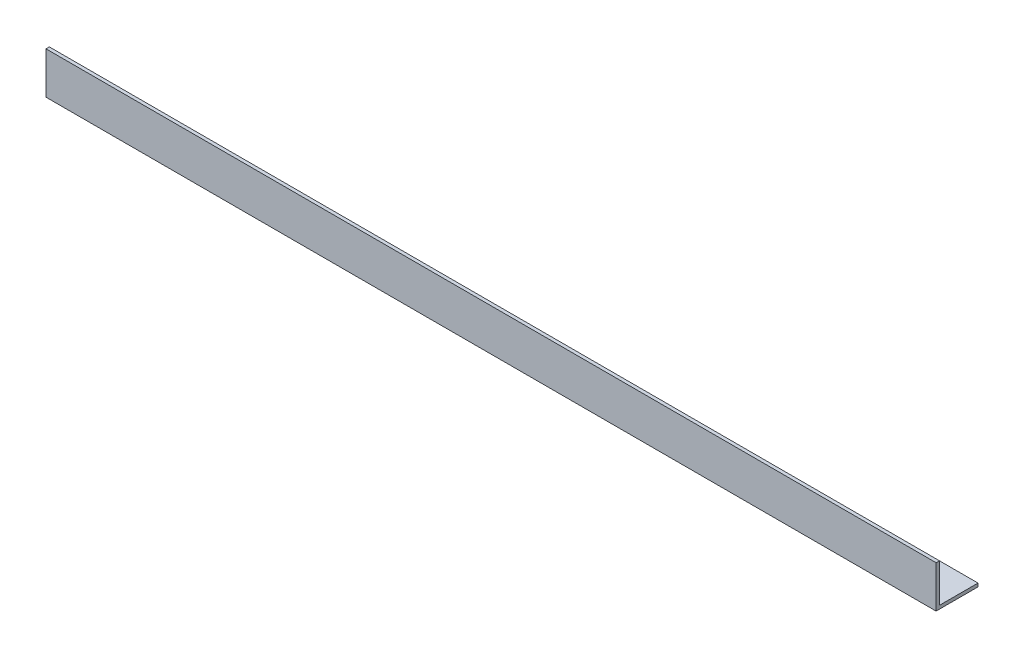
ISO-10303-21;
HEADER;
FILE_DESCRIPTION(('STEP AP214'),'2;1');
FILE_NAME('part.step','',(''),(''),'','','');
FILE_SCHEMA(('AUTOMOTIVE_DESIGN { 1 0 10303 214 1 1 1 1 }'));
ENDSEC;
DATA;
#1=APPLICATION_CONTEXT('core data for automotive mechanical design processes');
#2=APPLICATION_PROTOCOL_DEFINITION('international standard','automotive_design',2000,#1);
#3=PRODUCT_CONTEXT('',#1,'mechanical');
#4=PRODUCT('Part','Part','',(#3));
#5=PRODUCT_RELATED_PRODUCT_CATEGORY('part','',(#4));
#6=PRODUCT_DEFINITION_FORMATION('','',#4);
#7=PRODUCT_DEFINITION_CONTEXT('part definition',#1,'design');
#8=PRODUCT_DEFINITION('design','',#6,#7);
#9=PRODUCT_DEFINITION_SHAPE('','',#8);
#10=(LENGTH_UNIT() NAMED_UNIT(*) SI_UNIT(.MILLI.,.METRE.));
#11=(NAMED_UNIT(*) PLANE_ANGLE_UNIT() SI_UNIT($,.RADIAN.));
#12=(NAMED_UNIT(*) SI_UNIT($,.STERADIAN.) SOLID_ANGLE_UNIT());
#13=UNCERTAINTY_MEASURE_WITH_UNIT(LENGTH_MEASURE(1.E-05),#10,'distance_accuracy_value','');
#14=(GEOMETRIC_REPRESENTATION_CONTEXT(3) GLOBAL_UNCERTAINTY_ASSIGNED_CONTEXT((#13)) GLOBAL_UNIT_ASSIGNED_CONTEXT((#10,
#11,#12)) REPRESENTATION_CONTEXT('',''));
#15=CARTESIAN_POINT('',(0.,0.,0.));
#16=DIRECTION('',(0.,0.,1.));
#17=DIRECTION('',(1.,0.,0.));
#18=AXIS2_PLACEMENT_3D('',#15,#16,#17);
#19=CARTESIAN_POINT('',(531.,0.,0.));
#20=DIRECTION('',(0.,1.,0.));
#21=DIRECTION('',(0.,0.,1.));
#22=AXIS2_PLACEMENT_3D('',#19,#20,#21);
#23=PLANE('',#22);
#24=DIRECTION('',(0.,0.,-1.));
#25=VECTOR('',#24,1.);
#26=CARTESIAN_POINT('',(0.,0.,0.));
#27=LINE('',#26,#25);
#28=CARTESIAN_POINT('',(0.,0.,0.));
#29=VERTEX_POINT('',#28);
#30=CARTESIAN_POINT('',(0.,0.,-25.));
#31=VERTEX_POINT('',#30);
#32=EDGE_CURVE('E117',#29,#31,#27,.T.);
#33=ORIENTED_EDGE('',*,*,#32,.T.);
#34=DIRECTION('',(-1.,0.,0.));
#35=VECTOR('',#34,1.);
#36=CARTESIAN_POINT('',(531.,0.,-25.));
#37=LINE('',#36,#35);
#38=CARTESIAN_POINT('',(531.,0.,-25.));
#39=VERTEX_POINT('',#38);
#40=EDGE_CURVE('E11',#39,#31,#37,.T.);
#41=ORIENTED_EDGE('',*,*,#40,.F.);
#42=DIRECTION('',(0.,0.,-1.));
#43=VECTOR('',#42,1.);
#44=CARTESIAN_POINT('',(531.,0.,0.));
#45=LINE('',#44,#43);
#46=CARTESIAN_POINT('',(531.,0.,0.));
#47=VERTEX_POINT('',#46);
#48=EDGE_CURVE('E82',#47,#39,#45,.T.);
#49=ORIENTED_EDGE('',*,*,#48,.F.);
#50=DIRECTION('',(-1.,0.,0.));
#51=VECTOR('',#50,1.);
#52=CARTESIAN_POINT('',(531.,0.,0.));
#53=LINE('',#52,#51);
#54=EDGE_CURVE('E113',#47,#29,#53,.T.);
#55=ORIENTED_EDGE('',*,*,#54,.T.);
#56=EDGE_LOOP('',(#33,#41,#49,#55));
#57=FACE_BOUND('',#56,.T.);
#58=ADVANCED_FACE('F36',(#57),#23,.F.);
#59=CARTESIAN_POINT('',(531.,2.,-25.));
#60=DIRECTION('',(0.,0.,-1.));
#61=DIRECTION('',(-1.,0.,0.));
#62=AXIS2_PLACEMENT_3D('',#59,#60,#61);
#63=PLANE('',#62);
#64=DIRECTION('',(0.,-1.,0.));
#65=VECTOR('',#64,1.);
#66=CARTESIAN_POINT('',(0.,2.,-25.));
#67=LINE('',#66,#65);
#68=CARTESIAN_POINT('',(0.,2.,-25.));
#69=VERTEX_POINT('',#68);
#70=EDGE_CURVE('E120',#69,#31,#67,.T.);
#71=ORIENTED_EDGE('',*,*,#70,.F.);
#72=DIRECTION('',(-1.,0.,0.));
#73=VECTOR('',#72,1.);
#74=CARTESIAN_POINT('',(531.,2.,-25.));
#75=LINE('',#74,#73);
#76=CARTESIAN_POINT('',(531.,2.,-25.));
#77=VERTEX_POINT('',#76);
#78=EDGE_CURVE('E44',#77,#69,#75,.T.);
#79=ORIENTED_EDGE('',*,*,#78,.F.);
#80=DIRECTION('',(0.,-1.,0.));
#81=VECTOR('',#80,1.);
#82=CARTESIAN_POINT('',(531.,2.,-25.));
#83=LINE('',#82,#81);
#84=EDGE_CURVE('E206',#77,#39,#83,.T.);
#85=ORIENTED_EDGE('',*,*,#84,.T.);
#86=ORIENTED_EDGE('',*,*,#40,.T.);
#87=EDGE_LOOP('',(#71,#79,#85,#86));
#88=FACE_BOUND('',#87,.T.);
#89=ADVANCED_FACE('F138',(#88),#63,.T.);
#90=CARTESIAN_POINT('',(531.,2.,0.));
#91=DIRECTION('',(0.,1.,0.));
#92=DIRECTION('',(0.,0.,1.));
#93=AXIS2_PLACEMENT_3D('',#90,#91,#92);
#94=PLANE('',#93);
#95=DIRECTION('',(0.,0.,-1.));
#96=VECTOR('',#95,1.);
#97=CARTESIAN_POINT('',(0.,2.,0.));
#98=LINE('',#97,#96);
#99=CARTESIAN_POINT('',(0.,2.,-2.));
#100=VERTEX_POINT('',#99);
#101=EDGE_CURVE('E123',#100,#69,#98,.T.);
#102=ORIENTED_EDGE('',*,*,#101,.F.);
#103=DIRECTION('',(-1.,0.,0.));
#104=VECTOR('',#103,1.);
#105=CARTESIAN_POINT('',(531.,2.,-2.));
#106=LINE('',#105,#104);
#107=CARTESIAN_POINT('',(531.,2.,-2.));
#108=VERTEX_POINT('',#107);
#109=EDGE_CURVE('E103',#108,#100,#106,.T.);
#110=ORIENTED_EDGE('',*,*,#109,.F.);
#111=DIRECTION('',(0.,0.,-1.));
#112=VECTOR('',#111,1.);
#113=CARTESIAN_POINT('',(531.,2.,0.));
#114=LINE('',#113,#112);
#115=EDGE_CURVE('E109',#108,#77,#114,.T.);
#116=ORIENTED_EDGE('',*,*,#115,.T.);
#117=ORIENTED_EDGE('',*,*,#78,.T.);
#118=EDGE_LOOP('',(#102,#110,#116,#117));
#119=FACE_BOUND('',#118,.T.);
#120=ADVANCED_FACE('F135',(#119),#94,.T.);
#121=CARTESIAN_POINT('',(531.,25.,-2.));
#122=DIRECTION('',(0.,0.,-1.));
#123=DIRECTION('',(0.,1.,0.));
#124=AXIS2_PLACEMENT_3D('',#121,#122,#123);
#125=PLANE('',#124);
#126=DIRECTION('',(0.,-1.,0.));
#127=VECTOR('',#126,1.);
#128=CARTESIAN_POINT('',(0.,25.,-2.));
#129=LINE('',#128,#127);
#130=CARTESIAN_POINT('',(0.,25.,-2.));
#131=VERTEX_POINT('',#130);
#132=EDGE_CURVE('E98',#131,#100,#129,.T.);
#133=ORIENTED_EDGE('',*,*,#132,.F.);
#134=DIRECTION('',(-1.,0.,0.));
#135=VECTOR('',#134,1.);
#136=CARTESIAN_POINT('',(531.,25.,-2.));
#137=LINE('',#136,#135);
#138=CARTESIAN_POINT('',(531.,25.,-2.));
#139=VERTEX_POINT('',#138);
#140=EDGE_CURVE('E93',#139,#131,#137,.T.);
#141=ORIENTED_EDGE('',*,*,#140,.F.);
#142=DIRECTION('',(0.,-1.,0.));
#143=VECTOR('',#142,1.);
#144=CARTESIAN_POINT('',(531.,25.,-2.));
#145=LINE('',#144,#143);
#146=EDGE_CURVE('E96',#139,#108,#145,.T.);
#147=ORIENTED_EDGE('',*,*,#146,.T.);
#148=ORIENTED_EDGE('',*,*,#109,.T.);
#149=EDGE_LOOP('',(#133,#141,#147,#148));
#150=FACE_BOUND('',#149,.T.);
#151=ADVANCED_FACE('F95',(#150),#125,.T.);
#152=CARTESIAN_POINT('',(531.,25.,0.));
#153=DIRECTION('',(0.,1.,0.));
#154=DIRECTION('',(0.,0.,1.));
#155=AXIS2_PLACEMENT_3D('',#152,#153,#154);
#156=PLANE('',#155);
#157=DIRECTION('',(0.,0.,-1.));
#158=VECTOR('',#157,1.);
#159=CARTESIAN_POINT('',(0.,25.,0.));
#160=LINE('',#159,#158);
#161=CARTESIAN_POINT('',(0.,25.,0.));
#162=VERTEX_POINT('',#161);
#163=EDGE_CURVE('E127',#162,#131,#160,.T.);
#164=ORIENTED_EDGE('',*,*,#163,.F.);
#165=DIRECTION('',(-1.,0.,0.));
#166=VECTOR('',#165,1.);
#167=CARTESIAN_POINT('',(531.,25.,0.));
#168=LINE('',#167,#166);
#169=CARTESIAN_POINT('',(531.,25.,0.));
#170=VERTEX_POINT('',#169);
#171=EDGE_CURVE('E73',#170,#162,#168,.T.);
#172=ORIENTED_EDGE('',*,*,#171,.F.);
#173=DIRECTION('',(0.,0.,-1.));
#174=VECTOR('',#173,1.);
#175=CARTESIAN_POINT('',(531.,25.,0.));
#176=LINE('',#175,#174);
#177=EDGE_CURVE('E107',#170,#139,#176,.T.);
#178=ORIENTED_EDGE('',*,*,#177,.T.);
#179=ORIENTED_EDGE('',*,*,#140,.T.);
#180=EDGE_LOOP('',(#164,#172,#178,#179));
#181=FACE_BOUND('',#180,.T.);
#182=ADVANCED_FACE('F111',(#181),#156,.T.);
#183=CARTESIAN_POINT('',(531.,25.,0.));
#184=DIRECTION('',(0.,0.,-1.));
#185=DIRECTION('',(0.,1.,0.));
#186=AXIS2_PLACEMENT_3D('',#183,#184,#185);
#187=PLANE('',#186);
#188=DIRECTION('',(0.,-1.,0.));
#189=VECTOR('',#188,1.);
#190=CARTESIAN_POINT('',(0.,25.,0.));
#191=LINE('',#190,#189);
#192=EDGE_CURVE('E76',#162,#29,#191,.T.);
#193=ORIENTED_EDGE('',*,*,#192,.T.);
#194=ORIENTED_EDGE('',*,*,#54,.F.);
#195=DIRECTION('',(0.,-1.,0.));
#196=VECTOR('',#195,1.);
#197=CARTESIAN_POINT('',(531.,25.,0.));
#198=LINE('',#197,#196);
#199=EDGE_CURVE('E52',#170,#47,#198,.T.);
#200=ORIENTED_EDGE('',*,*,#199,.F.);
#201=ORIENTED_EDGE('',*,*,#171,.T.);
#202=EDGE_LOOP('',(#193,#194,#200,#201));
#203=FACE_BOUND('',#202,.T.);
#204=ADVANCED_FACE('F143',(#203),#187,.F.);
#205=CARTESIAN_POINT('',(531.,0.,0.));
#206=DIRECTION('',(-1.,0.,0.));
#207=DIRECTION('',(0.,0.,1.));
#208=AXIS2_PLACEMENT_3D('',#205,#206,#207);
#209=PLANE('',#208);
#210=ORIENTED_EDGE('',*,*,#48,.T.);
#211=ORIENTED_EDGE('',*,*,#84,.F.);
#212=ORIENTED_EDGE('',*,*,#115,.F.);
#213=ORIENTED_EDGE('',*,*,#146,.F.);
#214=ORIENTED_EDGE('',*,*,#177,.F.);
#215=ORIENTED_EDGE('',*,*,#199,.T.);
#216=EDGE_LOOP('',(#210,#211,#212,#213,#214,#215));
#217=FACE_BOUND('',#216,.T.);
#218=ADVANCED_FACE('F106',(#217),#209,.F.);
#219=CARTESIAN_POINT('',(0.,0.,0.));
#220=DIRECTION('',(-1.,0.,0.));
#221=DIRECTION('',(0.,0.,1.));
#222=AXIS2_PLACEMENT_3D('',#219,#220,#221);
#223=PLANE('',#222);
#224=ORIENTED_EDGE('',*,*,#32,.F.);
#225=ORIENTED_EDGE('',*,*,#192,.F.);
#226=ORIENTED_EDGE('',*,*,#163,.T.);
#227=ORIENTED_EDGE('',*,*,#132,.T.);
#228=ORIENTED_EDGE('',*,*,#101,.T.);
#229=ORIENTED_EDGE('',*,*,#70,.T.);
#230=EDGE_LOOP('',(#224,#225,#226,#227,#228,#229));
#231=FACE_BOUND('',#230,.T.);
#232=ADVANCED_FACE('F141',(#231),#223,.T.);
#233=CLOSED_SHELL('',(#58,#89,#120,#151,#182,#204,#218,#232));
#234=MANIFOLD_SOLID_BREP('B2',#233);
#235=ADVANCED_BREP_SHAPE_REPRESENTATION('',(#18,#234),#14);
#236=SHAPE_DEFINITION_REPRESENTATION(#9,#235);
ENDSEC;
END-ISO-10303-21;
